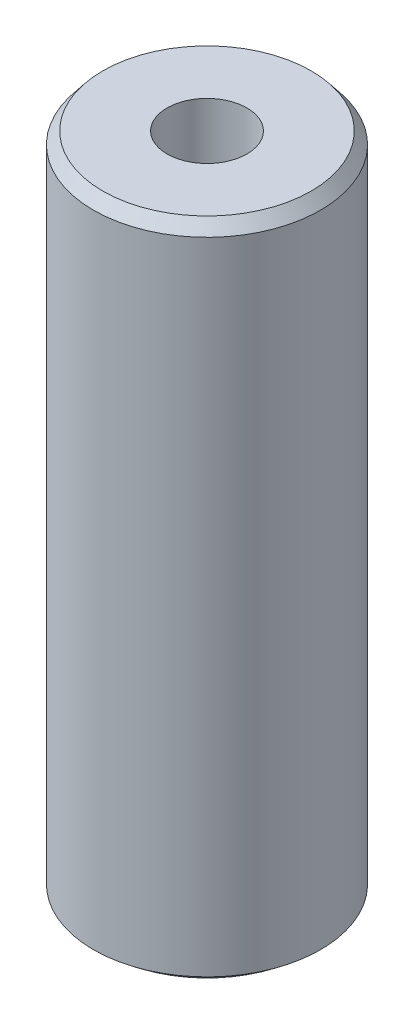
ISO-10303-21;
HEADER;
FILE_DESCRIPTION(('STEP AP214'),'2;1');
FILE_NAME('part.step','',(''),(''),'','','');
FILE_SCHEMA(('AUTOMOTIVE_DESIGN { 1 0 10303 214 1 1 1 1 }'));
ENDSEC;
DATA;
#1=APPLICATION_CONTEXT('core data for automotive mechanical design processes');
#2=APPLICATION_PROTOCOL_DEFINITION('international standard','automotive_design',2000,#1);
#3=PRODUCT_CONTEXT('',#1,'mechanical');
#4=PRODUCT('Part','Part','',(#3));
#5=PRODUCT_RELATED_PRODUCT_CATEGORY('part','',(#4));
#6=PRODUCT_DEFINITION_FORMATION('','',#4);
#7=PRODUCT_DEFINITION_CONTEXT('part definition',#1,'design');
#8=PRODUCT_DEFINITION('design','',#6,#7);
#9=PRODUCT_DEFINITION_SHAPE('','',#8);
#10=(LENGTH_UNIT() NAMED_UNIT(*) SI_UNIT(.MILLI.,.METRE.));
#11=(NAMED_UNIT(*) PLANE_ANGLE_UNIT() SI_UNIT($,.RADIAN.));
#12=(NAMED_UNIT(*) SI_UNIT($,.STERADIAN.) SOLID_ANGLE_UNIT());
#13=UNCERTAINTY_MEASURE_WITH_UNIT(LENGTH_MEASURE(1.E-05),#10,'distance_accuracy_value','');
#14=(GEOMETRIC_REPRESENTATION_CONTEXT(3) GLOBAL_UNCERTAINTY_ASSIGNED_CONTEXT((#13)) GLOBAL_UNIT_ASSIGNED_CONTEXT((#10,
#11,#12)) REPRESENTATION_CONTEXT('',''));
#15=CARTESIAN_POINT('',(0.,0.,0.));
#16=DIRECTION('',(0.,0.,1.));
#17=DIRECTION('',(1.,0.,0.));
#18=AXIS2_PLACEMENT_3D('',#15,#16,#17);
#19=CARTESIAN_POINT('',(0.,262.228788978458,0.));
#20=DIRECTION('',(0.,-1.,0.));
#21=DIRECTION('',(0.,0.,-1.));
#22=AXIS2_PLACEMENT_3D('',#19,#20,#21);
#23=CYLINDRICAL_SURFACE('',#22,45.);
#24=CARTESIAN_POINT('',(0.,257.533133416846,0.));
#25=DIRECTION('',(0.,1.,0.));
#26=DIRECTION('',(0.,0.,1.));
#27=AXIS2_PLACEMENT_3D('',#24,#25,#26);
#28=CIRCLE('',#27,45.);
#29=CARTESIAN_POINT('',(0.,257.533133416846,45.));
#30=VERTEX_POINT('',#29);
#31=EDGE_CURVE('E50',#30,#30,#28,.F.);
#32=ORIENTED_EDGE('',*,*,#31,.T.);
#33=EDGE_LOOP('',(#32));
#34=FACE_BOUND('',#33,.T.);
#35=CARTESIAN_POINT('',(0.,3.7141425379002,0.));
#36=DIRECTION('',(0.,1.,0.));
#37=DIRECTION('',(0.,0.,1.));
#38=AXIS2_PLACEMENT_3D('',#35,#36,#37);
#39=CIRCLE('',#38,45.);
#40=CARTESIAN_POINT('',(0.,3.7141425379002,45.));
#41=VERTEX_POINT('',#40);
#42=EDGE_CURVE('E51',#41,#41,#39,.T.);
#43=ORIENTED_EDGE('',*,*,#42,.T.);
#44=EDGE_LOOP('',(#43));
#45=FACE_BOUND('',#44,.T.);
#46=ADVANCED_FACE('F39',(#34,#45),#23,.T.);
#47=CARTESIAN_POINT('',(0.,262.228788978458,0.));
#48=DIRECTION('',(0.,1.,0.));
#49=DIRECTION('',(0.,0.,1.));
#50=AXIS2_PLACEMENT_3D('',#47,#48,#49);
#51=PLANE('',#50);
#52=CARTESIAN_POINT('',(0.,262.228788978458,0.));
#53=DIRECTION('',(0.,1.,0.));
#54=DIRECTION('',(0.,0.,1.));
#55=AXIS2_PLACEMENT_3D('',#52,#53,#54);
#56=CIRCLE('',#55,41.2858574620998);
#57=CARTESIAN_POINT('',(0.,262.228788978458,41.2858574620998));
#58=VERTEX_POINT('',#57);
#59=EDGE_CURVE('E54',#58,#58,#56,.T.);
#60=ORIENTED_EDGE('',*,*,#59,.T.);
#61=EDGE_LOOP('',(#60));
#62=FACE_BOUND('',#61,.T.);
#63=CARTESIAN_POINT('',(0.,262.228788978458,0.));
#64=DIRECTION('',(0.,1.,0.));
#65=DIRECTION('',(0.,0.,1.));
#66=AXIS2_PLACEMENT_3D('',#63,#64,#65);
#67=CIRCLE('',#66,15.8208436785342);
#68=CARTESIAN_POINT('',(0.,262.228788978458,15.8208436785342));
#69=VERTEX_POINT('',#68);
#70=EDGE_CURVE('E58',#69,#69,#67,.T.);
#71=ORIENTED_EDGE('',*,*,#70,.F.);
#72=EDGE_LOOP('',(#71));
#73=FACE_BOUND('',#72,.T.);
#74=ADVANCED_FACE('F69',(#62,#73),#51,.T.);
#75=CARTESIAN_POINT('',(0.,0.,0.));
#76=DIRECTION('',(0.,1.,0.));
#77=DIRECTION('',(0.,0.,1.));
#78=AXIS2_PLACEMENT_3D('',#75,#76,#77);
#79=PLANE('',#78);
#80=CARTESIAN_POINT('',(0.,0.,0.));
#81=DIRECTION('',(0.,1.,0.));
#82=DIRECTION('',(0.,0.,1.));
#83=AXIS2_PLACEMENT_3D('',#80,#81,#82);
#84=CIRCLE('',#83,40.3043444383887);
#85=CARTESIAN_POINT('',(0.,0.,40.3043444383887));
#86=VERTEX_POINT('',#85);
#87=EDGE_CURVE('E10',#86,#86,#84,.F.);
#88=ORIENTED_EDGE('',*,*,#87,.T.);
#89=EDGE_LOOP('',(#88));
#90=FACE_BOUND('',#89,.T.);
#91=CARTESIAN_POINT('',(0.,0.,0.));
#92=DIRECTION('',(0.,1.,0.));
#93=DIRECTION('',(0.,0.,1.));
#94=AXIS2_PLACEMENT_3D('',#91,#92,#93);
#95=CIRCLE('',#94,15.8208436785342);
#96=CARTESIAN_POINT('',(0.,0.,15.8208436785342));
#97=VERTEX_POINT('',#96);
#98=EDGE_CURVE('E63',#97,#97,#95,.T.);
#99=ORIENTED_EDGE('',*,*,#98,.T.);
#100=EDGE_LOOP('',(#99));
#101=FACE_BOUND('',#100,.T.);
#102=ADVANCED_FACE('F75',(#90,#101),#79,.F.);
#103=CARTESIAN_POINT('',(0.,262.228788978458,0.));
#104=DIRECTION('',(0.,-1.,0.));
#105=DIRECTION('',(0.,0.,-1.));
#106=AXIS2_PLACEMENT_3D('',#103,#104,#105);
#107=CYLINDRICAL_SURFACE('',#106,15.8208436785342);
#108=ORIENTED_EDGE('',*,*,#70,.T.);
#109=EDGE_LOOP('',(#108));
#110=FACE_BOUND('',#109,.T.);
#111=ORIENTED_EDGE('',*,*,#98,.F.);
#112=EDGE_LOOP('',(#111));
#113=FACE_BOUND('',#112,.T.);
#114=ADVANCED_FACE('F70',(#110,#113),#107,.F.);
#115=CARTESIAN_POINT('',(0.,262.228788978458,0.));
#116=DIRECTION('',(0.,-1.,0.));
#117=DIRECTION('',(0.,0.,-1.));
#118=AXIS2_PLACEMENT_3D('',#115,#116,#117);
#119=CONICAL_SURFACE('',#118,41.2858574620998,0.669213141545901);
#120=ORIENTED_EDGE('',*,*,#31,.F.);
#121=EDGE_LOOP('',(#120));
#122=FACE_BOUND('',#121,.T.);
#123=ORIENTED_EDGE('',*,*,#59,.F.);
#124=EDGE_LOOP('',(#123));
#125=FACE_BOUND('',#124,.T.);
#126=ADVANCED_FACE('F81',(#122,#125),#119,.T.);
#127=CARTESIAN_POINT('',(0.,3.7141425379002,0.));
#128=DIRECTION('',(0.,1.,0.));
#129=DIRECTION('',(0.,0.,1.));
#130=AXIS2_PLACEMENT_3D('',#127,#128,#129);
#131=CONICAL_SURFACE('',#130,45.,0.901583185249);
#132=ORIENTED_EDGE('',*,*,#87,.F.);
#133=EDGE_LOOP('',(#132));
#134=FACE_BOUND('',#133,.T.);
#135=ORIENTED_EDGE('',*,*,#42,.F.);
#136=EDGE_LOOP('',(#135));
#137=FACE_BOUND('',#136,.T.);
#138=ADVANCED_FACE('F45',(#134,#137),#131,.T.);
#139=CLOSED_SHELL('',(#46,#74,#102,#114,#126,#138));
#140=MANIFOLD_SOLID_BREP('B2',#139);
#141=ADVANCED_BREP_SHAPE_REPRESENTATION('',(#18,#140),#14);
#142=SHAPE_DEFINITION_REPRESENTATION(#9,#141);
ENDSEC;
END-ISO-10303-21;
